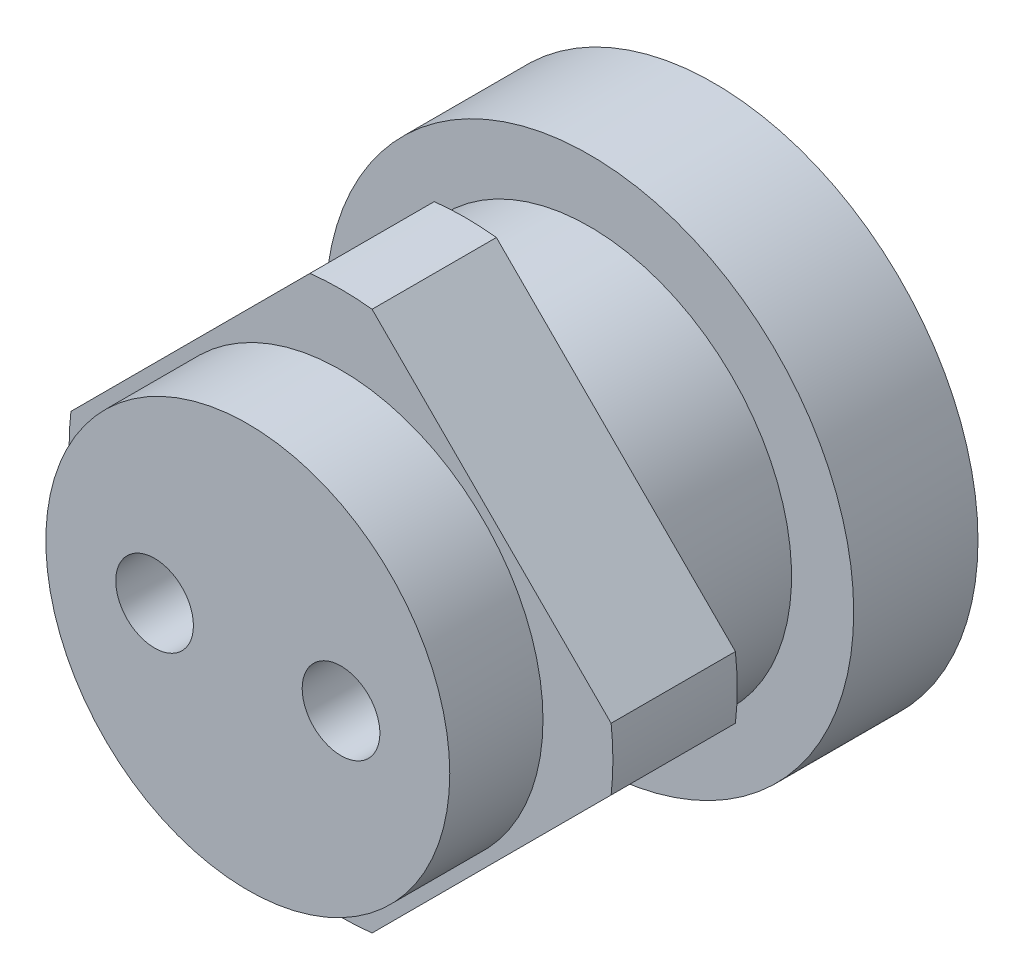
ISO-10303-21;
HEADER;
FILE_DESCRIPTION(('STEP AP214'),'2;1');
FILE_NAME('part.step','',(''),(''),'','','');
FILE_SCHEMA(('AUTOMOTIVE_DESIGN { 1 0 10303 214 1 1 1 1 }'));
ENDSEC;
DATA;
#1=APPLICATION_CONTEXT('core data for automotive mechanical design processes');
#2=APPLICATION_PROTOCOL_DEFINITION('international standard','automotive_design',2000,#1);
#3=PRODUCT_CONTEXT('',#1,'mechanical');
#4=PRODUCT('Part','Part','',(#3));
#5=PRODUCT_RELATED_PRODUCT_CATEGORY('part','',(#4));
#6=PRODUCT_DEFINITION_FORMATION('','',#4);
#7=PRODUCT_DEFINITION_CONTEXT('part definition',#1,'design');
#8=PRODUCT_DEFINITION('design','',#6,#7);
#9=PRODUCT_DEFINITION_SHAPE('','',#8);
#10=(LENGTH_UNIT() NAMED_UNIT(*) SI_UNIT(.MILLI.,.METRE.));
#11=(NAMED_UNIT(*) PLANE_ANGLE_UNIT() SI_UNIT($,.RADIAN.));
#12=(NAMED_UNIT(*) SI_UNIT($,.STERADIAN.) SOLID_ANGLE_UNIT());
#13=UNCERTAINTY_MEASURE_WITH_UNIT(LENGTH_MEASURE(1.E-05),#10,'distance_accuracy_value','');
#14=(GEOMETRIC_REPRESENTATION_CONTEXT(3) GLOBAL_UNCERTAINTY_ASSIGNED_CONTEXT((#13)) GLOBAL_UNIT_ASSIGNED_CONTEXT((#10,
#11,#12)) REPRESENTATION_CONTEXT('',''));
#15=CARTESIAN_POINT('',(0.,0.,0.));
#16=DIRECTION('',(0.,0.,1.));
#17=DIRECTION('',(1.,0.,0.));
#18=AXIS2_PLACEMENT_3D('',#15,#16,#17);
#19=CARTESIAN_POINT('',(0.,0.,16.));
#20=DIRECTION('',(0.,0.,1.));
#21=DIRECTION('',(1.,0.,0.));
#22=AXIS2_PLACEMENT_3D('',#19,#20,#21);
#23=PLANE('',#22);
#24=CARTESIAN_POINT('',(0.,0.,16.));
#25=DIRECTION('',(0.,0.,1.));
#26=DIRECTION('',(1.,0.,0.));
#27=AXIS2_PLACEMENT_3D('',#24,#25,#26);
#28=CIRCLE('',#27,17.5);
#29=CARTESIAN_POINT('',(17.3853386507137,-2.00000000000011,16.));
#30=VERTEX_POINT('',#29);
#31=CARTESIAN_POINT('',(17.3853386507137,2.00000000000001,16.));
#32=VERTEX_POINT('',#31);
#33=EDGE_CURVE('E147',#30,#32,#28,.T.);
#34=ORIENTED_EDGE('',*,*,#33,.T.);
#35=DIRECTION('',(-0.707106781186544,0.707106781186551,0.));
#36=VECTOR('',#35,1.);
#37=CARTESIAN_POINT('',(2.00000000000018,17.3853386507137,16.));
#38=LINE('',#37,#36);
#39=CARTESIAN_POINT('',(2.00000000000018,17.3853386507137,16.));
#40=VERTEX_POINT('',#39);
#41=EDGE_CURVE('E95',#32,#40,#38,.T.);
#42=ORIENTED_EDGE('',*,*,#41,.T.);
#43=CARTESIAN_POINT('',(0.,0.,16.));
#44=DIRECTION('',(0.,0.,1.));
#45=DIRECTION('',(1.,0.,0.));
#46=AXIS2_PLACEMENT_3D('',#43,#44,#45);
#47=CIRCLE('',#46,17.5);
#48=CARTESIAN_POINT('',(-1.99999999999994,17.3853386507137,16.));
#49=VERTEX_POINT('',#48);
#50=EDGE_CURVE('E195',#40,#49,#47,.T.);
#51=ORIENTED_EDGE('',*,*,#50,.T.);
#52=DIRECTION('',(-0.707106781186551,-0.707106781186544,0.));
#53=VECTOR('',#52,1.);
#54=CARTESIAN_POINT('',(-17.3853386507137,2.00000000000012,16.));
#55=LINE('',#54,#53);
#56=CARTESIAN_POINT('',(-17.3853386507137,2.00000000000012,16.));
#57=VERTEX_POINT('',#56);
#58=EDGE_CURVE('E197',#49,#57,#55,.T.);
#59=ORIENTED_EDGE('',*,*,#58,.T.);
#60=CARTESIAN_POINT('',(0.,0.,16.));
#61=DIRECTION('',(0.,0.,1.));
#62=DIRECTION('',(1.,0.,0.));
#63=AXIS2_PLACEMENT_3D('',#60,#61,#62);
#64=CIRCLE('',#63,17.5);
#65=CARTESIAN_POINT('',(-17.3853386507137,-1.99999999999988,16.));
#66=VERTEX_POINT('',#65);
#67=EDGE_CURVE('E114',#57,#66,#64,.T.);
#68=ORIENTED_EDGE('',*,*,#67,.T.);
#69=DIRECTION('',(0.707106781186544,-0.707106781186551,0.));
#70=VECTOR('',#69,1.);
#71=CARTESIAN_POINT('',(-2.00000000000006,-17.3853386507137,16.));
#72=LINE('',#71,#70);
#73=CARTESIAN_POINT('',(-2.00000000000007,-17.3853386507137,16.));
#74=VERTEX_POINT('',#73);
#75=EDGE_CURVE('E108',#66,#74,#72,.T.);
#76=ORIENTED_EDGE('',*,*,#75,.T.);
#77=CARTESIAN_POINT('',(0.,0.,16.));
#78=DIRECTION('',(0.,0.,1.));
#79=DIRECTION('',(1.,0.,0.));
#80=AXIS2_PLACEMENT_3D('',#77,#78,#79);
#81=CIRCLE('',#80,17.5);
#82=CARTESIAN_POINT('',(1.99999999999994,-17.3853386507137,16.));
#83=VERTEX_POINT('',#82);
#84=EDGE_CURVE('E112',#74,#83,#81,.T.);
#85=ORIENTED_EDGE('',*,*,#84,.T.);
#86=DIRECTION('',(0.707106781186551,0.707106781186544,0.));
#87=VECTOR('',#86,1.);
#88=CARTESIAN_POINT('',(17.3853386507137,-2.00000000000011,16.));
#89=LINE('',#88,#87);
#90=EDGE_CURVE('E51',#83,#30,#89,.T.);
#91=ORIENTED_EDGE('',*,*,#90,.T.);
#92=EDGE_LOOP('',(#34,#42,#51,#59,#68,#76,#85,#91));
#93=FACE_BOUND('',#92,.T.);
#94=CARTESIAN_POINT('',(0.,0.,16.));
#95=DIRECTION('',(0.,0.,1.));
#96=DIRECTION('',(1.,0.,0.));
#97=AXIS2_PLACEMENT_3D('',#94,#95,#96);
#98=CIRCLE('',#97,13.);
#99=CARTESIAN_POINT('',(13.,0.,16.));
#100=VERTEX_POINT('',#99);
#101=EDGE_CURVE('E187',#100,#100,#98,.T.);
#102=ORIENTED_EDGE('',*,*,#101,.F.);
#103=EDGE_LOOP('',(#102));
#104=FACE_BOUND('',#103,.T.);
#105=ADVANCED_FACE('F32',(#93,#104),#23,.T.);
#106=CARTESIAN_POINT('',(0.,0.,8.));
#107=DIRECTION('',(0.,0.,-1.));
#108=DIRECTION('',(-1.,0.,0.));
#109=AXIS2_PLACEMENT_3D('',#106,#107,#108);
#110=CYLINDRICAL_SURFACE('',#109,13.);
#111=CARTESIAN_POINT('',(0.,0.,8.));
#112=DIRECTION('',(0.,0.,1.));
#113=DIRECTION('',(1.,0.,0.));
#114=AXIS2_PLACEMENT_3D('',#111,#112,#113);
#115=CIRCLE('',#114,13.);
#116=CARTESIAN_POINT('',(13.,0.,8.));
#117=VERTEX_POINT('',#116);
#118=EDGE_CURVE('E11',#117,#117,#115,.T.);
#119=ORIENTED_EDGE('',*,*,#118,.F.);
#120=EDGE_LOOP('',(#119));
#121=FACE_BOUND('',#120,.T.);
#122=CARTESIAN_POINT('',(0.,0.,0.));
#123=DIRECTION('',(0.,0.,-1.));
#124=DIRECTION('',(-1.,0.,0.));
#125=AXIS2_PLACEMENT_3D('',#122,#123,#124);
#126=CIRCLE('',#125,13.);
#127=CARTESIAN_POINT('',(-13.,0.,0.));
#128=VERTEX_POINT('',#127);
#129=EDGE_CURVE('E42',#128,#128,#126,.T.);
#130=ORIENTED_EDGE('',*,*,#129,.F.);
#131=EDGE_LOOP('',(#130));
#132=FACE_BOUND('',#131,.T.);
#133=ADVANCED_FACE('F34',(#121,#132),#110,.T.);
#134=CARTESIAN_POINT('',(0.,0.,0.));
#135=DIRECTION('',(0.,0.,-1.));
#136=DIRECTION('',(-1.,0.,0.));
#137=AXIS2_PLACEMENT_3D('',#134,#135,#136);
#138=PLANE('',#137);
#139=CARTESIAN_POINT('',(0.,0.,0.));
#140=DIRECTION('',(0.,0.,-1.));
#141=DIRECTION('',(-1.,0.,0.));
#142=AXIS2_PLACEMENT_3D('',#139,#140,#141);
#143=CIRCLE('',#142,17.);
#144=CARTESIAN_POINT('',(-17.,0.,0.));
#145=VERTEX_POINT('',#144);
#146=EDGE_CURVE('E162',#145,#145,#143,.T.);
#147=ORIENTED_EDGE('',*,*,#146,.F.);
#148=EDGE_LOOP('',(#147));
#149=FACE_BOUND('',#148,.T.);
#150=ORIENTED_EDGE('',*,*,#129,.T.);
#151=EDGE_LOOP('',(#150));
#152=FACE_BOUND('',#151,.T.);
#153=ADVANCED_FACE('F235',(#149,#152),#138,.F.);
#154=CARTESIAN_POINT('',(0.,0.,-8.));
#155=DIRECTION('',(0.,0.,1.));
#156=DIRECTION('',(1.,0.,0.));
#157=AXIS2_PLACEMENT_3D('',#154,#155,#156);
#158=CYLINDRICAL_SURFACE('',#157,17.);
#159=CARTESIAN_POINT('',(0.,0.,-8.));
#160=DIRECTION('',(0.,0.,-1.));
#161=DIRECTION('',(-1.,0.,0.));
#162=AXIS2_PLACEMENT_3D('',#159,#160,#161);
#163=CIRCLE('',#162,17.);
#164=CARTESIAN_POINT('',(-17.,0.,-8.));
#165=VERTEX_POINT('',#164);
#166=EDGE_CURVE('E163',#165,#165,#163,.T.);
#167=ORIENTED_EDGE('',*,*,#166,.F.);
#168=EDGE_LOOP('',(#167));
#169=FACE_BOUND('',#168,.T.);
#170=ORIENTED_EDGE('',*,*,#146,.T.);
#171=EDGE_LOOP('',(#170));
#172=FACE_BOUND('',#171,.T.);
#173=ADVANCED_FACE('F246',(#169,#172),#158,.T.);
#174=CARTESIAN_POINT('',(0.,0.,-8.));
#175=DIRECTION('',(0.,0.,-1.));
#176=DIRECTION('',(-1.,0.,0.));
#177=AXIS2_PLACEMENT_3D('',#174,#175,#176);
#178=PLANE('',#177);
#179=CARTESIAN_POINT('',(0.,0.,-8.));
#180=DIRECTION('',(0.,0.,-1.));
#181=DIRECTION('',(-1.,0.,0.));
#182=AXIS2_PLACEMENT_3D('',#179,#180,#181);
#183=CIRCLE('',#182,10.);
#184=CARTESIAN_POINT('',(-10.,0.,-8.));
#185=VERTEX_POINT('',#184);
#186=EDGE_CURVE('E171',#185,#185,#183,.T.);
#187=ORIENTED_EDGE('',*,*,#186,.F.);
#188=EDGE_LOOP('',(#187));
#189=FACE_BOUND('',#188,.T.);
#190=ORIENTED_EDGE('',*,*,#166,.T.);
#191=EDGE_LOOP('',(#190));
#192=FACE_BOUND('',#191,.T.);
#193=ADVANCED_FACE('F239',(#189,#192),#178,.T.);
#194=CARTESIAN_POINT('',(0.,0.,8.));
#195=DIRECTION('',(0.,0.,1.));
#196=DIRECTION('',(1.,0.,0.));
#197=AXIS2_PLACEMENT_3D('',#194,#195,#196);
#198=PLANE('',#197);
#199=CARTESIAN_POINT('',(0.,0.,8.));
#200=DIRECTION('',(0.,0.,1.));
#201=DIRECTION('',(1.,0.,0.));
#202=AXIS2_PLACEMENT_3D('',#199,#200,#201);
#203=CIRCLE('',#202,17.5);
#204=CARTESIAN_POINT('',(17.3853386507137,-2.00000000000011,8.));
#205=VERTEX_POINT('',#204);
#206=CARTESIAN_POINT('',(17.3853386507137,2.00000000000001,8.));
#207=VERTEX_POINT('',#206);
#208=EDGE_CURVE('E132',#205,#207,#203,.T.);
#209=ORIENTED_EDGE('',*,*,#208,.F.);
#210=DIRECTION('',(0.707106781186551,0.707106781186544,0.));
#211=VECTOR('',#210,1.);
#212=CARTESIAN_POINT('',(17.3853386507137,-2.00000000000011,8.));
#213=LINE('',#212,#211);
#214=CARTESIAN_POINT('',(1.99999999999994,-17.3853386507137,8.));
#215=VERTEX_POINT('',#214);
#216=EDGE_CURVE('E86',#215,#205,#213,.T.);
#217=ORIENTED_EDGE('',*,*,#216,.F.);
#218=CARTESIAN_POINT('',(0.,0.,8.));
#219=DIRECTION('',(0.,0.,1.));
#220=DIRECTION('',(1.,0.,0.));
#221=AXIS2_PLACEMENT_3D('',#218,#219,#220);
#222=CIRCLE('',#221,17.5);
#223=CARTESIAN_POINT('',(-2.00000000000007,-17.3853386507137,8.));
#224=VERTEX_POINT('',#223);
#225=EDGE_CURVE('E80',#224,#215,#222,.T.);
#226=ORIENTED_EDGE('',*,*,#225,.F.);
#227=DIRECTION('',(0.707106781186544,-0.707106781186551,0.));
#228=VECTOR('',#227,1.);
#229=CARTESIAN_POINT('',(-2.00000000000006,-17.3853386507137,8.));
#230=LINE('',#229,#228);
#231=CARTESIAN_POINT('',(-17.3853386507137,-1.99999999999988,8.));
#232=VERTEX_POINT('',#231);
#233=EDGE_CURVE('E122',#232,#224,#230,.T.);
#234=ORIENTED_EDGE('',*,*,#233,.F.);
#235=CARTESIAN_POINT('',(0.,0.,8.));
#236=DIRECTION('',(0.,0.,1.));
#237=DIRECTION('',(1.,0.,0.));
#238=AXIS2_PLACEMENT_3D('',#235,#236,#237);
#239=CIRCLE('',#238,17.5);
#240=CARTESIAN_POINT('',(-17.3853386507137,2.00000000000012,8.));
#241=VERTEX_POINT('',#240);
#242=EDGE_CURVE('E142',#241,#232,#239,.T.);
#243=ORIENTED_EDGE('',*,*,#242,.F.);
#244=DIRECTION('',(-0.707106781186551,-0.707106781186544,0.));
#245=VECTOR('',#244,1.);
#246=CARTESIAN_POINT('',(-17.3853386507137,2.00000000000012,8.));
#247=LINE('',#246,#245);
#248=CARTESIAN_POINT('',(-1.99999999999994,17.3853386507137,8.));
#249=VERTEX_POINT('',#248);
#250=EDGE_CURVE('E140',#249,#241,#247,.T.);
#251=ORIENTED_EDGE('',*,*,#250,.F.);
#252=CARTESIAN_POINT('',(0.,0.,8.));
#253=DIRECTION('',(0.,0.,1.));
#254=DIRECTION('',(1.,0.,0.));
#255=AXIS2_PLACEMENT_3D('',#252,#253,#254);
#256=CIRCLE('',#255,17.5);
#257=CARTESIAN_POINT('',(2.00000000000018,17.3853386507137,8.));
#258=VERTEX_POINT('',#257);
#259=EDGE_CURVE('E138',#258,#249,#256,.T.);
#260=ORIENTED_EDGE('',*,*,#259,.F.);
#261=DIRECTION('',(-0.707106781186544,0.707106781186551,0.));
#262=VECTOR('',#261,1.);
#263=CARTESIAN_POINT('',(2.00000000000018,17.3853386507137,8.));
#264=LINE('',#263,#262);
#265=EDGE_CURVE('E135',#207,#258,#264,.T.);
#266=ORIENTED_EDGE('',*,*,#265,.F.);
#267=EDGE_LOOP('',(#209,#217,#226,#234,#243,#251,#260,#266));
#268=FACE_BOUND('',#267,.T.);
#269=ORIENTED_EDGE('',*,*,#118,.T.);
#270=EDGE_LOOP('',(#269));
#271=FACE_BOUND('',#270,.T.);
#272=ADVANCED_FACE('F210',(#268,#271),#198,.F.);
#273=CARTESIAN_POINT('',(0.,0.,16.));
#274=DIRECTION('',(0.,0.,-1.));
#275=DIRECTION('',(-1.,0.,0.));
#276=AXIS2_PLACEMENT_3D('',#273,#274,#275);
#277=CYLINDRICAL_SURFACE('',#276,17.5);
#278=ORIENTED_EDGE('',*,*,#208,.T.);
#279=DIRECTION('',(0.,0.,-1.));
#280=VECTOR('',#279,1.);
#281=CARTESIAN_POINT('',(17.3853386507137,2.00000000000001,16.));
#282=LINE('',#281,#280);
#283=EDGE_CURVE('E160',#32,#207,#282,.T.);
#284=ORIENTED_EDGE('',*,*,#283,.F.);
#285=ORIENTED_EDGE('',*,*,#33,.F.);
#286=DIRECTION('',(0.,0.,-1.));
#287=VECTOR('',#286,1.);
#288=CARTESIAN_POINT('',(17.3853386507137,-2.00000000000011,16.));
#289=LINE('',#288,#287);
#290=EDGE_CURVE('E128',#30,#205,#289,.T.);
#291=ORIENTED_EDGE('',*,*,#290,.T.);
#292=EDGE_LOOP('',(#278,#284,#285,#291));
#293=FACE_BOUND('',#292,.T.);
#294=ADVANCED_FACE('F215',(#293),#277,.T.);
#295=CARTESIAN_POINT('',(2.00000000000018,17.3853386507137,16.));
#296=DIRECTION('',(-0.707106781186551,-0.707106781186544,0.));
#297=DIRECTION('',(0.707106781186544,-0.707106781186551,0.));
#298=AXIS2_PLACEMENT_3D('',#295,#296,#297);
#299=PLANE('',#298);
#300=ORIENTED_EDGE('',*,*,#265,.T.);
#301=DIRECTION('',(0.,0.,-1.));
#302=VECTOR('',#301,1.);
#303=CARTESIAN_POINT('',(2.00000000000018,17.3853386507137,16.));
#304=LINE('',#303,#302);
#305=EDGE_CURVE('E157',#40,#258,#304,.T.);
#306=ORIENTED_EDGE('',*,*,#305,.F.);
#307=ORIENTED_EDGE('',*,*,#41,.F.);
#308=ORIENTED_EDGE('',*,*,#283,.T.);
#309=EDGE_LOOP('',(#300,#306,#307,#308));
#310=FACE_BOUND('',#309,.T.);
#311=ADVANCED_FACE('F244',(#310),#299,.F.);
#312=CARTESIAN_POINT('',(0.,0.,16.));
#313=DIRECTION('',(0.,0.,-1.));
#314=DIRECTION('',(-1.,0.,0.));
#315=AXIS2_PLACEMENT_3D('',#312,#313,#314);
#316=CYLINDRICAL_SURFACE('',#315,17.5);
#317=ORIENTED_EDGE('',*,*,#259,.T.);
#318=DIRECTION('',(0.,0.,-1.));
#319=VECTOR('',#318,1.);
#320=CARTESIAN_POINT('',(-1.99999999999994,17.3853386507137,16.));
#321=LINE('',#320,#319);
#322=EDGE_CURVE('E154',#49,#249,#321,.T.);
#323=ORIENTED_EDGE('',*,*,#322,.F.);
#324=ORIENTED_EDGE('',*,*,#50,.F.);
#325=ORIENTED_EDGE('',*,*,#305,.T.);
#326=EDGE_LOOP('',(#317,#323,#324,#325));
#327=FACE_BOUND('',#326,.T.);
#328=ADVANCED_FACE('F292',(#327),#316,.T.);
#329=CARTESIAN_POINT('',(-17.3853386507137,2.00000000000012,16.));
#330=DIRECTION('',(0.707106781186544,-0.707106781186551,0.));
#331=DIRECTION('',(0.707106781186551,0.707106781186544,0.));
#332=AXIS2_PLACEMENT_3D('',#329,#330,#331);
#333=PLANE('',#332);
#334=ORIENTED_EDGE('',*,*,#250,.T.);
#335=DIRECTION('',(0.,0.,-1.));
#336=VECTOR('',#335,1.);
#337=CARTESIAN_POINT('',(-17.3853386507137,2.00000000000012,16.));
#338=LINE('',#337,#336);
#339=EDGE_CURVE('E151',#57,#241,#338,.T.);
#340=ORIENTED_EDGE('',*,*,#339,.F.);
#341=ORIENTED_EDGE('',*,*,#58,.F.);
#342=ORIENTED_EDGE('',*,*,#322,.T.);
#343=EDGE_LOOP('',(#334,#340,#341,#342));
#344=FACE_BOUND('',#343,.T.);
#345=ADVANCED_FACE('F203',(#344),#333,.F.);
#346=CARTESIAN_POINT('',(0.,0.,16.));
#347=DIRECTION('',(0.,0.,-1.));
#348=DIRECTION('',(-1.,0.,0.));
#349=AXIS2_PLACEMENT_3D('',#346,#347,#348);
#350=CYLINDRICAL_SURFACE('',#349,17.5);
#351=ORIENTED_EDGE('',*,*,#242,.T.);
#352=DIRECTION('',(0.,0.,-1.));
#353=VECTOR('',#352,1.);
#354=CARTESIAN_POINT('',(-17.3853386507137,-1.99999999999988,16.));
#355=LINE('',#354,#353);
#356=EDGE_CURVE('E123',#66,#232,#355,.T.);
#357=ORIENTED_EDGE('',*,*,#356,.F.);
#358=ORIENTED_EDGE('',*,*,#67,.F.);
#359=ORIENTED_EDGE('',*,*,#339,.T.);
#360=EDGE_LOOP('',(#351,#357,#358,#359));
#361=FACE_BOUND('',#360,.T.);
#362=ADVANCED_FACE('F207',(#361),#350,.T.);
#363=CARTESIAN_POINT('',(-2.00000000000006,-17.3853386507137,16.));
#364=DIRECTION('',(0.707106781186551,0.707106781186544,0.));
#365=DIRECTION('',(-0.707106781186544,0.707106781186551,0.));
#366=AXIS2_PLACEMENT_3D('',#363,#364,#365);
#367=PLANE('',#366);
#368=ORIENTED_EDGE('',*,*,#233,.T.);
#369=DIRECTION('',(0.,0.,-1.));
#370=VECTOR('',#369,1.);
#371=CARTESIAN_POINT('',(-2.00000000000007,-17.3853386507137,16.));
#372=LINE('',#371,#370);
#373=EDGE_CURVE('E119',#74,#224,#372,.T.);
#374=ORIENTED_EDGE('',*,*,#373,.F.);
#375=ORIENTED_EDGE('',*,*,#75,.F.);
#376=ORIENTED_EDGE('',*,*,#356,.T.);
#377=EDGE_LOOP('',(#368,#374,#375,#376));
#378=FACE_BOUND('',#377,.T.);
#379=ADVANCED_FACE('F120',(#378),#367,.F.);
#380=CARTESIAN_POINT('',(0.,0.,16.));
#381=DIRECTION('',(0.,0.,-1.));
#382=DIRECTION('',(-1.,0.,0.));
#383=AXIS2_PLACEMENT_3D('',#380,#381,#382);
#384=CYLINDRICAL_SURFACE('',#383,17.5);
#385=ORIENTED_EDGE('',*,*,#225,.T.);
#386=DIRECTION('',(0.,0.,-1.));
#387=VECTOR('',#386,1.);
#388=CARTESIAN_POINT('',(1.99999999999994,-17.3853386507137,16.));
#389=LINE('',#388,#387);
#390=EDGE_CURVE('E124',#83,#215,#389,.T.);
#391=ORIENTED_EDGE('',*,*,#390,.F.);
#392=ORIENTED_EDGE('',*,*,#84,.F.);
#393=ORIENTED_EDGE('',*,*,#373,.T.);
#394=EDGE_LOOP('',(#385,#391,#392,#393));
#395=FACE_BOUND('',#394,.T.);
#396=ADVANCED_FACE('F126',(#395),#384,.T.);
#397=CARTESIAN_POINT('',(17.3853386507137,-2.00000000000011,16.));
#398=DIRECTION('',(-0.707106781186544,0.707106781186551,0.));
#399=DIRECTION('',(-0.707106781186551,-0.707106781186544,0.));
#400=AXIS2_PLACEMENT_3D('',#397,#398,#399);
#401=PLANE('',#400);
#402=ORIENTED_EDGE('',*,*,#216,.T.);
#403=ORIENTED_EDGE('',*,*,#290,.F.);
#404=ORIENTED_EDGE('',*,*,#90,.F.);
#405=ORIENTED_EDGE('',*,*,#390,.T.);
#406=EDGE_LOOP('',(#402,#403,#404,#405));
#407=FACE_BOUND('',#406,.T.);
#408=ADVANCED_FACE('F217',(#407),#401,.F.);
#409=CARTESIAN_POINT('',(0.,0.,22.));
#410=DIRECTION('',(0.,0.,-1.));
#411=DIRECTION('',(-1.,0.,0.));
#412=AXIS2_PLACEMENT_3D('',#409,#410,#411);
#413=CYLINDRICAL_SURFACE('',#412,13.);
#414=CARTESIAN_POINT('',(0.,0.,22.));
#415=DIRECTION('',(0.,0.,1.));
#416=DIRECTION('',(1.,0.,0.));
#417=AXIS2_PLACEMENT_3D('',#414,#415,#416);
#418=CIRCLE('',#417,13.);
#419=CARTESIAN_POINT('',(13.,0.,22.));
#420=VERTEX_POINT('',#419);
#421=EDGE_CURVE('E136',#420,#420,#418,.T.);
#422=ORIENTED_EDGE('',*,*,#421,.F.);
#423=EDGE_LOOP('',(#422));
#424=FACE_BOUND('',#423,.T.);
#425=ORIENTED_EDGE('',*,*,#101,.T.);
#426=EDGE_LOOP('',(#425));
#427=FACE_BOUND('',#426,.T.);
#428=ADVANCED_FACE('F219',(#424,#427),#413,.T.);
#429=CARTESIAN_POINT('',(0.,0.,22.));
#430=DIRECTION('',(0.,0.,1.));
#431=DIRECTION('',(1.,0.,0.));
#432=AXIS2_PLACEMENT_3D('',#429,#430,#431);
#433=PLANE('',#432);
#434=CARTESIAN_POINT('',(6.,0.,22.));
#435=DIRECTION('',(0.,0.,1.));
#436=DIRECTION('',(-1.,0.,0.));
#437=AXIS2_PLACEMENT_3D('',#434,#435,#436);
#438=CIRCLE('',#437,2.5);
#439=CARTESIAN_POINT('',(3.5,0.,22.));
#440=VERTEX_POINT('',#439);
#441=EDGE_CURVE('E183',#440,#440,#438,.T.);
#442=ORIENTED_EDGE('',*,*,#441,.F.);
#443=EDGE_LOOP('',(#442));
#444=FACE_BOUND('',#443,.T.);
#445=CARTESIAN_POINT('',(-6.,0.,22.));
#446=DIRECTION('',(0.,0.,1.));
#447=DIRECTION('',(1.,0.,0.));
#448=AXIS2_PLACEMENT_3D('',#445,#446,#447);
#449=CIRCLE('',#448,2.5);
#450=CARTESIAN_POINT('',(-3.5,0.,22.));
#451=VERTEX_POINT('',#450);
#452=EDGE_CURVE('E172',#451,#451,#449,.T.);
#453=ORIENTED_EDGE('',*,*,#452,.F.);
#454=EDGE_LOOP('',(#453));
#455=FACE_BOUND('',#454,.T.);
#456=ORIENTED_EDGE('',*,*,#421,.T.);
#457=EDGE_LOOP('',(#456));
#458=FACE_BOUND('',#457,.T.);
#459=ADVANCED_FACE('F225',(#444,#455,#458),#433,.T.);
#460=CARTESIAN_POINT('',(0.,0.,17.));
#461=DIRECTION('',(0.,0.,-1.));
#462=DIRECTION('',(-1.,0.,0.));
#463=AXIS2_PLACEMENT_3D('',#460,#461,#462);
#464=CYLINDRICAL_SURFACE('',#463,10.);
#465=CARTESIAN_POINT('',(0.,0.,17.));
#466=DIRECTION('',(0.,0.,-1.));
#467=DIRECTION('',(-1.,0.,0.));
#468=AXIS2_PLACEMENT_3D('',#465,#466,#467);
#469=CIRCLE('',#468,10.);
#470=CARTESIAN_POINT('',(-10.,0.,17.));
#471=VERTEX_POINT('',#470);
#472=EDGE_CURVE('E176',#471,#471,#469,.T.);
#473=ORIENTED_EDGE('',*,*,#472,.F.);
#474=EDGE_LOOP('',(#473));
#475=FACE_BOUND('',#474,.T.);
#476=ORIENTED_EDGE('',*,*,#186,.T.);
#477=EDGE_LOOP('',(#476));
#478=FACE_BOUND('',#477,.T.);
#479=ADVANCED_FACE('F354',(#475,#478),#464,.F.);
#480=CARTESIAN_POINT('',(0.,0.,17.));
#481=DIRECTION('',(0.,0.,-1.));
#482=DIRECTION('',(-1.,0.,0.));
#483=AXIS2_PLACEMENT_3D('',#480,#481,#482);
#484=PLANE('',#483);
#485=CARTESIAN_POINT('',(6.,0.,17.));
#486=DIRECTION('',(0.,0.,-1.));
#487=DIRECTION('',(-1.,0.,0.));
#488=AXIS2_PLACEMENT_3D('',#485,#486,#487);
#489=CIRCLE('',#488,2.5);
#490=CARTESIAN_POINT('',(3.5,0.,17.));
#491=VERTEX_POINT('',#490);
#492=EDGE_CURVE('E36',#491,#491,#489,.T.);
#493=ORIENTED_EDGE('',*,*,#492,.F.);
#494=EDGE_LOOP('',(#493));
#495=FACE_BOUND('',#494,.T.);
#496=CARTESIAN_POINT('',(-6.,0.,17.));
#497=DIRECTION('',(0.,0.,-1.));
#498=DIRECTION('',(-1.,0.,0.));
#499=AXIS2_PLACEMENT_3D('',#496,#497,#498);
#500=CIRCLE('',#499,2.5);
#501=CARTESIAN_POINT('',(-8.5,0.,17.));
#502=VERTEX_POINT('',#501);
#503=EDGE_CURVE('E169',#502,#502,#500,.T.);
#504=ORIENTED_EDGE('',*,*,#503,.F.);
#505=EDGE_LOOP('',(#504));
#506=FACE_BOUND('',#505,.T.);
#507=ORIENTED_EDGE('',*,*,#472,.T.);
#508=EDGE_LOOP('',(#507));
#509=FACE_BOUND('',#508,.T.);
#510=ADVANCED_FACE('F359',(#495,#506,#509),#484,.T.);
#511=CARTESIAN_POINT('',(-6.,0.,-10.5));
#512=DIRECTION('',(0.,0.,1.));
#513=DIRECTION('',(1.,0.,0.));
#514=AXIS2_PLACEMENT_3D('',#511,#512,#513);
#515=CYLINDRICAL_SURFACE('',#514,2.5);
#516=ORIENTED_EDGE('',*,*,#503,.T.);
#517=EDGE_LOOP('',(#516));
#518=FACE_BOUND('',#517,.T.);
#519=ORIENTED_EDGE('',*,*,#452,.T.);
#520=EDGE_LOOP('',(#519));
#521=FACE_BOUND('',#520,.T.);
#522=ADVANCED_FACE('F367',(#518,#521),#515,.F.);
#523=CARTESIAN_POINT('',(6.,0.,-10.5));
#524=DIRECTION('',(0.,0.,1.));
#525=DIRECTION('',(1.,0.,0.));
#526=AXIS2_PLACEMENT_3D('',#523,#524,#525);
#527=CYLINDRICAL_SURFACE('',#526,2.5);
#528=ORIENTED_EDGE('',*,*,#492,.T.);
#529=EDGE_LOOP('',(#528));
#530=FACE_BOUND('',#529,.T.);
#531=ORIENTED_EDGE('',*,*,#441,.T.);
#532=EDGE_LOOP('',(#531));
#533=FACE_BOUND('',#532,.T.);
#534=ADVANCED_FACE('F372',(#530,#533),#527,.F.);
#535=CLOSED_SHELL('',(#105,#133,#153,#173,#193,#272,#294,#311,#328,#345,#362,#379,#396,#408,
#428,#459,#479,#510,#522,#534));
#536=MANIFOLD_SOLID_BREP('B2',#535);
#537=ADVANCED_BREP_SHAPE_REPRESENTATION('',(#18,#536),#14);
#538=SHAPE_DEFINITION_REPRESENTATION(#9,#537);
ENDSEC;
END-ISO-10303-21;
